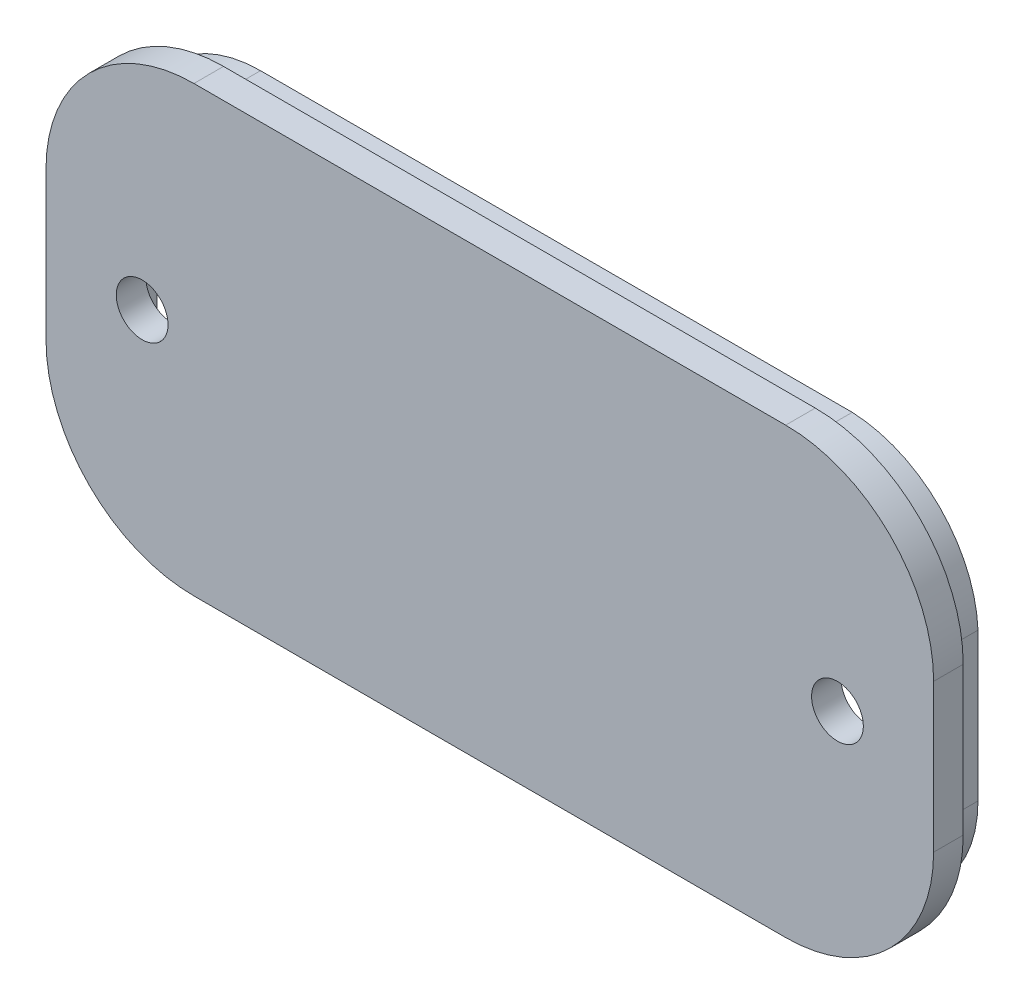
ISO-10303-21;
HEADER;
FILE_DESCRIPTION(('STEP AP214'),'2;1');
FILE_NAME('part.step','',(''),(''),'','','');
FILE_SCHEMA(('AUTOMOTIVE_DESIGN { 1 0 10303 214 1 1 1 1 }'));
ENDSEC;
DATA;
#1=APPLICATION_CONTEXT('core data for automotive mechanical design processes');
#2=APPLICATION_PROTOCOL_DEFINITION('international standard','automotive_design',2000,#1);
#3=PRODUCT_CONTEXT('',#1,'mechanical');
#4=PRODUCT('Part','Part','',(#3));
#5=PRODUCT_RELATED_PRODUCT_CATEGORY('part','',(#4));
#6=PRODUCT_DEFINITION_FORMATION('','',#4);
#7=PRODUCT_DEFINITION_CONTEXT('part definition',#1,'design');
#8=PRODUCT_DEFINITION('design','',#6,#7);
#9=PRODUCT_DEFINITION_SHAPE('','',#8);
#10=(LENGTH_UNIT() NAMED_UNIT(*) SI_UNIT(.MILLI.,.METRE.));
#11=(NAMED_UNIT(*) PLANE_ANGLE_UNIT() SI_UNIT($,.RADIAN.));
#12=(NAMED_UNIT(*) SI_UNIT($,.STERADIAN.) SOLID_ANGLE_UNIT());
#13=UNCERTAINTY_MEASURE_WITH_UNIT(LENGTH_MEASURE(1.E-05),#10,'distance_accuracy_value','');
#14=(GEOMETRIC_REPRESENTATION_CONTEXT(3) GLOBAL_UNCERTAINTY_ASSIGNED_CONTEXT((#13)) GLOBAL_UNIT_ASSIGNED_CONTEXT((#10,
#11,#12)) REPRESENTATION_CONTEXT('',''));
#15=CARTESIAN_POINT('',(0.,0.,0.));
#16=DIRECTION('',(0.,0.,1.));
#17=DIRECTION('',(1.,0.,0.));
#18=AXIS2_PLACEMENT_3D('',#15,#16,#17);
#19=CARTESIAN_POINT('',(-20.,-2.,0.));
#20=DIRECTION('',(0.,0.,1.));
#21=DIRECTION('',(1.,0.,0.));
#22=AXIS2_PLACEMENT_3D('',#19,#20,#21);
#23=PLANE('',#22);
#24=CARTESIAN_POINT('',(-23.5,3.,0.));
#25=DIRECTION('',(0.,0.,1.));
#26=DIRECTION('',(1.,0.,0.));
#27=AXIS2_PLACEMENT_3D('',#24,#25,#26);
#28=CIRCLE('',#27,1.75);
#29=CARTESIAN_POINT('',(-21.75,3.,0.));
#30=VERTEX_POINT('',#29);
#31=EDGE_CURVE('E313',#30,#30,#28,.T.);
#32=ORIENTED_EDGE('',*,*,#31,.T.);
#33=EDGE_LOOP('',(#32));
#34=FACE_BOUND('',#33,.T.);
#35=CARTESIAN_POINT('',(23.5,3.,0.));
#36=DIRECTION('',(0.,0.,1.));
#37=DIRECTION('',(1.,0.,0.));
#38=AXIS2_PLACEMENT_3D('',#35,#36,#37);
#39=CIRCLE('',#38,1.75);
#40=CARTESIAN_POINT('',(25.25,3.,0.));
#41=VERTEX_POINT('',#40);
#42=EDGE_CURVE('E347',#41,#41,#39,.T.);
#43=ORIENTED_EDGE('',*,*,#42,.T.);
#44=EDGE_LOOP('',(#43));
#45=FACE_BOUND('',#44,.T.);
#46=CARTESIAN_POINT('',(-19.6238436825551,-1.62384368255508,0.));
#47=DIRECTION('',(0.,0.,1.));
#48=DIRECTION('',(1.,0.,0.));
#49=AXIS2_PLACEMENT_3D('',#46,#47,#48);
#50=CIRCLE('',#49,7.38412317265306);
#51=CARTESIAN_POINT('',(-27.0079668552081,-1.62384368255508,0.));
#52=VERTEX_POINT('',#51);
#53=CARTESIAN_POINT('',(-19.6238436825551,-9.00796685520814,0.));
#54=VERTEX_POINT('',#53);
#55=EDGE_CURVE('E270',#52,#54,#50,.T.);
#56=ORIENTED_EDGE('',*,*,#55,.F.);
#57=DIRECTION('',(0.,1.,0.));
#58=VECTOR('',#57,1.);
#59=CARTESIAN_POINT('',(-27.0079668552081,0.,0.));
#60=LINE('',#59,#58);
#61=CARTESIAN_POINT('',(-27.0079668552082,7.62384368255508,0.));
#62=VERTEX_POINT('',#61);
#63=EDGE_CURVE('E210',#52,#62,#60,.T.);
#64=ORIENTED_EDGE('',*,*,#63,.T.);
#65=CARTESIAN_POINT('',(-19.6238436825551,7.62384368255508,0.));
#66=DIRECTION('',(0.,0.,1.));
#67=DIRECTION('',(1.,0.,0.));
#68=AXIS2_PLACEMENT_3D('',#65,#66,#67);
#69=CIRCLE('',#68,7.38412317265306);
#70=CARTESIAN_POINT('',(-19.6238436825551,15.0079668552081,0.));
#71=VERTEX_POINT('',#70);
#72=EDGE_CURVE('E52',#62,#71,#69,.F.);
#73=ORIENTED_EDGE('',*,*,#72,.T.);
#74=DIRECTION('',(0.99999991759081,-0.000405978292554137,0.));
#75=VECTOR('',#74,1.);
#76=CARTESIAN_POINT('',(0.00608967388646691,14.9999975277244,0.));
#77=LINE('',#76,#75);
#78=CARTESIAN_POINT('',(0.,15.,0.));
#79=VERTEX_POINT('',#78);
#80=EDGE_CURVE('E274',#71,#79,#77,.T.);
#81=ORIENTED_EDGE('',*,*,#80,.T.);
#82=DIRECTION('',(-0.99999991759081,-0.000405978292554402,0.));
#83=VECTOR('',#82,1.);
#84=CARTESIAN_POINT('',(-0.00608967388647089,14.9999975277244,0.));
#85=LINE('',#84,#83);
#86=CARTESIAN_POINT('',(19.6238436825551,15.0079668552081,0.));
#87=VERTEX_POINT('',#86);
#88=EDGE_CURVE('E277',#87,#79,#85,.T.);
#89=ORIENTED_EDGE('',*,*,#88,.F.);
#90=CARTESIAN_POINT('',(19.6238436825551,7.62384368255508,0.));
#91=DIRECTION('',(0.,0.,1.));
#92=DIRECTION('',(1.,0.,0.));
#93=AXIS2_PLACEMENT_3D('',#90,#91,#92);
#94=CIRCLE('',#93,7.38412317265306);
#95=CARTESIAN_POINT('',(27.0079668552082,7.62384368255508,0.));
#96=VERTEX_POINT('',#95);
#97=EDGE_CURVE('E280',#96,#87,#94,.T.);
#98=ORIENTED_EDGE('',*,*,#97,.F.);
#99=DIRECTION('',(0.,1.,0.));
#100=VECTOR('',#99,1.);
#101=CARTESIAN_POINT('',(27.0079668552082,0.,0.));
#102=LINE('',#101,#100);
#103=CARTESIAN_POINT('',(27.0079668552082,-1.62384368255507,0.));
#104=VERTEX_POINT('',#103);
#105=EDGE_CURVE('E282',#104,#96,#102,.T.);
#106=ORIENTED_EDGE('',*,*,#105,.F.);
#107=CARTESIAN_POINT('',(19.6238436825551,-1.62384368255507,0.));
#108=DIRECTION('',(0.,0.,1.));
#109=DIRECTION('',(1.,0.,0.));
#110=AXIS2_PLACEMENT_3D('',#107,#108,#109);
#111=CIRCLE('',#110,7.38412317265306);
#112=CARTESIAN_POINT('',(19.6238436825551,-9.00796685520813,0.));
#113=VERTEX_POINT('',#112);
#114=EDGE_CURVE('E284',#104,#113,#111,.F.);
#115=ORIENTED_EDGE('',*,*,#114,.T.);
#116=DIRECTION('',(-1.,0.,0.));
#117=VECTOR('',#116,1.);
#118=CARTESIAN_POINT('',(0.,-9.00796685520814,0.));
#119=LINE('',#118,#117);
#120=EDGE_CURVE('E287',#113,#54,#119,.T.);
#121=ORIENTED_EDGE('',*,*,#120,.T.);
#122=EDGE_LOOP('',(#56,#64,#73,#81,#89,#98,#106,#115,#121));
#123=FACE_BOUND('',#122,.T.);
#124=ADVANCED_FACE('F37',(#34,#45,#123),#23,.F.);
#125=CARTESIAN_POINT('',(-20.,-2.,0.));
#126=DIRECTION('',(0.,0.,1.));
#127=DIRECTION('',(1.,0.,0.));
#128=AXIS2_PLACEMENT_3D('',#125,#126,#127);
#129=CIRCLE('',#128,10.);
#130=CARTESIAN_POINT('',(-30.,-2.,0.));
#131=VERTEX_POINT('',#130);
#132=CARTESIAN_POINT('',(-20.,-12.,0.));
#133=VERTEX_POINT('',#132);
#134=EDGE_CURVE('E353',#131,#133,#129,.T.);
#135=ORIENTED_EDGE('',*,*,#134,.F.);
#136=DIRECTION('',(0.,-1.,0.));
#137=VECTOR('',#136,1.);
#138=CARTESIAN_POINT('',(-30.,8.,0.));
#139=LINE('',#138,#137);
#140=CARTESIAN_POINT('',(-30.,8.,0.));
#141=VERTEX_POINT('',#140);
#142=EDGE_CURVE('E360',#141,#131,#139,.T.);
#143=ORIENTED_EDGE('',*,*,#142,.F.);
#144=CARTESIAN_POINT('',(-20.,8.,0.));
#145=DIRECTION('',(0.,0.,1.));
#146=DIRECTION('',(1.,0.,0.));
#147=AXIS2_PLACEMENT_3D('',#144,#145,#146);
#148=CIRCLE('',#147,10.);
#149=CARTESIAN_POINT('',(-20.,18.,0.));
#150=VERTEX_POINT('',#149);
#151=EDGE_CURVE('E387',#150,#141,#148,.T.);
#152=ORIENTED_EDGE('',*,*,#151,.F.);
#153=DIRECTION('',(-1.,0.,0.));
#154=VECTOR('',#153,1.);
#155=CARTESIAN_POINT('',(20.,18.,0.));
#156=LINE('',#155,#154);
#157=CARTESIAN_POINT('',(20.,18.,0.));
#158=VERTEX_POINT('',#157);
#159=EDGE_CURVE('E385',#158,#150,#156,.T.);
#160=ORIENTED_EDGE('',*,*,#159,.F.);
#161=CARTESIAN_POINT('',(20.,8.,0.));
#162=DIRECTION('',(0.,0.,1.));
#163=DIRECTION('',(1.,0.,0.));
#164=AXIS2_PLACEMENT_3D('',#161,#162,#163);
#165=CIRCLE('',#164,10.);
#166=CARTESIAN_POINT('',(30.,8.,0.));
#167=VERTEX_POINT('',#166);
#168=EDGE_CURVE('E383',#167,#158,#165,.T.);
#169=ORIENTED_EDGE('',*,*,#168,.F.);
#170=DIRECTION('',(0.,1.,0.));
#171=VECTOR('',#170,1.);
#172=CARTESIAN_POINT('',(30.,-2.,0.));
#173=LINE('',#172,#171);
#174=CARTESIAN_POINT('',(30.,-2.,0.));
#175=VERTEX_POINT('',#174);
#176=EDGE_CURVE('E381',#175,#167,#173,.T.);
#177=ORIENTED_EDGE('',*,*,#176,.F.);
#178=CARTESIAN_POINT('',(20.,-2.,0.));
#179=DIRECTION('',(0.,0.,1.));
#180=DIRECTION('',(1.,0.,0.));
#181=AXIS2_PLACEMENT_3D('',#178,#179,#180);
#182=CIRCLE('',#181,10.);
#183=CARTESIAN_POINT('',(20.,-12.,0.));
#184=VERTEX_POINT('',#183);
#185=EDGE_CURVE('E379',#184,#175,#182,.T.);
#186=ORIENTED_EDGE('',*,*,#185,.F.);
#187=DIRECTION('',(1.,0.,0.));
#188=VECTOR('',#187,1.);
#189=CARTESIAN_POINT('',(-20.,-12.,0.));
#190=LINE('',#189,#188);
#191=EDGE_CURVE('E377',#133,#184,#190,.T.);
#192=ORIENTED_EDGE('',*,*,#191,.F.);
#193=EDGE_LOOP('',(#135,#143,#152,#160,#169,#177,#186,#192));
#194=FACE_BOUND('',#193,.T.);
#195=DIRECTION('',(1.,0.,0.));
#196=VECTOR('',#195,1.);
#197=CARTESIAN_POINT('',(0.,16.5,0.));
#198=LINE('',#197,#196);
#199=CARTESIAN_POINT('',(-20.,16.5,0.));
#200=VERTEX_POINT('',#199);
#201=CARTESIAN_POINT('',(20.,16.5,0.));
#202=VERTEX_POINT('',#201);
#203=EDGE_CURVE('E290',#200,#202,#198,.T.);
#204=ORIENTED_EDGE('',*,*,#203,.F.);
#205=CARTESIAN_POINT('',(-20.,8.,0.));
#206=DIRECTION('',(0.,0.,1.));
#207=DIRECTION('',(1.,0.,0.));
#208=AXIS2_PLACEMENT_3D('',#205,#206,#207);
#209=CIRCLE('',#208,8.5);
#210=CARTESIAN_POINT('',(-28.5,8.,0.));
#211=VERTEX_POINT('',#210);
#212=EDGE_CURVE('E293',#200,#211,#209,.T.);
#213=ORIENTED_EDGE('',*,*,#212,.T.);
#214=DIRECTION('',(0.,-1.,0.));
#215=VECTOR('',#214,1.);
#216=CARTESIAN_POINT('',(-28.5,0.,0.));
#217=LINE('',#216,#215);
#218=CARTESIAN_POINT('',(-28.5,-2.,0.));
#219=VERTEX_POINT('',#218);
#220=EDGE_CURVE('E60',#211,#219,#217,.T.);
#221=ORIENTED_EDGE('',*,*,#220,.T.);
#222=CARTESIAN_POINT('',(-20.,-2.,0.));
#223=DIRECTION('',(0.,0.,1.));
#224=DIRECTION('',(1.,0.,0.));
#225=AXIS2_PLACEMENT_3D('',#222,#223,#224);
#226=CIRCLE('',#225,8.5);
#227=CARTESIAN_POINT('',(-20.,-10.5,0.));
#228=VERTEX_POINT('',#227);
#229=EDGE_CURVE('E297',#219,#228,#226,.T.);
#230=ORIENTED_EDGE('',*,*,#229,.T.);
#231=DIRECTION('',(1.,0.,0.));
#232=VECTOR('',#231,1.);
#233=CARTESIAN_POINT('',(0.,-10.5,0.));
#234=LINE('',#233,#232);
#235=CARTESIAN_POINT('',(20.,-10.5,0.));
#236=VERTEX_POINT('',#235);
#237=EDGE_CURVE('E300',#228,#236,#234,.T.);
#238=ORIENTED_EDGE('',*,*,#237,.T.);
#239=CARTESIAN_POINT('',(20.,-2.,0.));
#240=DIRECTION('',(0.,0.,1.));
#241=DIRECTION('',(1.,0.,0.));
#242=AXIS2_PLACEMENT_3D('',#239,#240,#241);
#243=CIRCLE('',#242,8.5);
#244=CARTESIAN_POINT('',(28.5,-1.99999999999999,0.));
#245=VERTEX_POINT('',#244);
#246=EDGE_CURVE('E303',#236,#245,#243,.T.);
#247=ORIENTED_EDGE('',*,*,#246,.T.);
#248=DIRECTION('',(0.,-1.,0.));
#249=VECTOR('',#248,1.);
#250=CARTESIAN_POINT('',(28.5,0.,0.));
#251=LINE('',#250,#249);
#252=CARTESIAN_POINT('',(28.5,8.00000000000001,0.));
#253=VERTEX_POINT('',#252);
#254=EDGE_CURVE('E306',#253,#245,#251,.T.);
#255=ORIENTED_EDGE('',*,*,#254,.F.);
#256=CARTESIAN_POINT('',(19.6238436825551,7.62384368255508,0.));
#257=DIRECTION('',(0.,0.,1.));
#258=DIRECTION('',(1.,0.,0.));
#259=AXIS2_PLACEMENT_3D('',#256,#257,#258);
#260=CIRCLE('',#259,8.88412317265306);
#261=EDGE_CURVE('E224',#253,#202,#260,.T.);
#262=ORIENTED_EDGE('',*,*,#261,.T.);
#263=EDGE_LOOP('',(#204,#213,#221,#230,#238,#247,#255,#262));
#264=FACE_BOUND('',#263,.T.);
#265=ADVANCED_FACE('F417',(#194,#264),#23,.F.);
#266=CARTESIAN_POINT('',(-20.,-2.,2.));
#267=DIRECTION('',(0.,0.,1.));
#268=DIRECTION('',(1.,0.,0.));
#269=AXIS2_PLACEMENT_3D('',#266,#267,#268);
#270=PLANE('',#269);
#271=CARTESIAN_POINT('',(23.5,3.,2.));
#272=DIRECTION('',(0.,0.,1.));
#273=DIRECTION('',(1.,0.,0.));
#274=AXIS2_PLACEMENT_3D('',#271,#272,#273);
#275=CIRCLE('',#274,1.75);
#276=CARTESIAN_POINT('',(25.25,3.,2.));
#277=VERTEX_POINT('',#276);
#278=EDGE_CURVE('E350',#277,#277,#275,.T.);
#279=ORIENTED_EDGE('',*,*,#278,.F.);
#280=EDGE_LOOP('',(#279));
#281=FACE_BOUND('',#280,.T.);
#282=CARTESIAN_POINT('',(-20.,-2.,2.));
#283=DIRECTION('',(0.,0.,1.));
#284=DIRECTION('',(1.,0.,0.));
#285=AXIS2_PLACEMENT_3D('',#282,#283,#284);
#286=CIRCLE('',#285,10.);
#287=CARTESIAN_POINT('',(-30.,-2.,2.));
#288=VERTEX_POINT('',#287);
#289=CARTESIAN_POINT('',(-20.,-12.,2.));
#290=VERTEX_POINT('',#289);
#291=EDGE_CURVE('E356',#288,#290,#286,.T.);
#292=ORIENTED_EDGE('',*,*,#291,.T.);
#293=DIRECTION('',(1.,0.,0.));
#294=VECTOR('',#293,1.);
#295=CARTESIAN_POINT('',(-20.,-12.,2.));
#296=LINE('',#295,#294);
#297=CARTESIAN_POINT('',(20.,-12.,2.));
#298=VERTEX_POINT('',#297);
#299=EDGE_CURVE('E359',#290,#298,#296,.T.);
#300=ORIENTED_EDGE('',*,*,#299,.T.);
#301=CARTESIAN_POINT('',(20.,-2.,2.));
#302=DIRECTION('',(0.,0.,1.));
#303=DIRECTION('',(1.,0.,0.));
#304=AXIS2_PLACEMENT_3D('',#301,#302,#303);
#305=CIRCLE('',#304,10.);
#306=CARTESIAN_POINT('',(30.,-2.,2.));
#307=VERTEX_POINT('',#306);
#308=EDGE_CURVE('E362',#298,#307,#305,.T.);
#309=ORIENTED_EDGE('',*,*,#308,.T.);
#310=DIRECTION('',(0.,1.,0.));
#311=VECTOR('',#310,1.);
#312=CARTESIAN_POINT('',(30.,-2.,2.));
#313=LINE('',#312,#311);
#314=CARTESIAN_POINT('',(30.,8.,2.));
#315=VERTEX_POINT('',#314);
#316=EDGE_CURVE('E364',#307,#315,#313,.T.);
#317=ORIENTED_EDGE('',*,*,#316,.T.);
#318=CARTESIAN_POINT('',(20.,8.,2.));
#319=DIRECTION('',(0.,0.,1.));
#320=DIRECTION('',(1.,0.,0.));
#321=AXIS2_PLACEMENT_3D('',#318,#319,#320);
#322=CIRCLE('',#321,10.);
#323=CARTESIAN_POINT('',(20.,18.,2.));
#324=VERTEX_POINT('',#323);
#325=EDGE_CURVE('E366',#315,#324,#322,.T.);
#326=ORIENTED_EDGE('',*,*,#325,.T.);
#327=DIRECTION('',(-1.,0.,0.));
#328=VECTOR('',#327,1.);
#329=CARTESIAN_POINT('',(20.,18.,2.));
#330=LINE('',#329,#328);
#331=CARTESIAN_POINT('',(-20.,18.,2.));
#332=VERTEX_POINT('',#331);
#333=EDGE_CURVE('E368',#324,#332,#330,.T.);
#334=ORIENTED_EDGE('',*,*,#333,.T.);
#335=CARTESIAN_POINT('',(-20.,8.,2.));
#336=DIRECTION('',(0.,0.,1.));
#337=DIRECTION('',(1.,0.,0.));
#338=AXIS2_PLACEMENT_3D('',#335,#336,#337);
#339=CIRCLE('',#338,10.);
#340=CARTESIAN_POINT('',(-30.,8.,2.));
#341=VERTEX_POINT('',#340);
#342=EDGE_CURVE('E370',#332,#341,#339,.T.);
#343=ORIENTED_EDGE('',*,*,#342,.T.);
#344=DIRECTION('',(0.,-1.,0.));
#345=VECTOR('',#344,1.);
#346=CARTESIAN_POINT('',(-30.,8.,2.));
#347=LINE('',#346,#345);
#348=EDGE_CURVE('E372',#341,#288,#347,.T.);
#349=ORIENTED_EDGE('',*,*,#348,.T.);
#350=EDGE_LOOP('',(#292,#300,#309,#317,#326,#334,#343,#349));
#351=FACE_BOUND('',#350,.T.);
#352=CARTESIAN_POINT('',(-23.5,3.,2.));
#353=DIRECTION('',(0.,0.,1.));
#354=DIRECTION('',(1.,0.,0.));
#355=AXIS2_PLACEMENT_3D('',#352,#353,#354);
#356=CIRCLE('',#355,1.75);
#357=CARTESIAN_POINT('',(-21.75,3.,2.));
#358=VERTEX_POINT('',#357);
#359=EDGE_CURVE('E344',#358,#358,#356,.T.);
#360=ORIENTED_EDGE('',*,*,#359,.F.);
#361=EDGE_LOOP('',(#360));
#362=FACE_BOUND('',#361,.T.);
#363=ADVANCED_FACE('F431',(#281,#351,#362),#270,.T.);
#364=CARTESIAN_POINT('',(-20.,-2.,2.));
#365=DIRECTION('',(0.,0.,-1.));
#366=DIRECTION('',(-1.,0.,0.));
#367=AXIS2_PLACEMENT_3D('',#364,#365,#366);
#368=CYLINDRICAL_SURFACE('',#367,10.);
#369=ORIENTED_EDGE('',*,*,#134,.T.);
#370=DIRECTION('',(0.,0.,-1.));
#371=VECTOR('',#370,1.);
#372=CARTESIAN_POINT('',(-20.,-12.,2.));
#373=LINE('',#372,#371);
#374=EDGE_CURVE('E11',#290,#133,#373,.T.);
#375=ORIENTED_EDGE('',*,*,#374,.F.);
#376=ORIENTED_EDGE('',*,*,#291,.F.);
#377=DIRECTION('',(0.,0.,-1.));
#378=VECTOR('',#377,1.);
#379=CARTESIAN_POINT('',(-30.,-2.,2.));
#380=LINE('',#379,#378);
#381=EDGE_CURVE('E374',#288,#131,#380,.T.);
#382=ORIENTED_EDGE('',*,*,#381,.T.);
#383=EDGE_LOOP('',(#369,#375,#376,#382));
#384=FACE_BOUND('',#383,.T.);
#385=ADVANCED_FACE('F39',(#384),#368,.T.);
#386=CARTESIAN_POINT('',(-20.,-12.,2.));
#387=DIRECTION('',(0.,1.,0.));
#388=DIRECTION('',(-1.,0.,0.));
#389=AXIS2_PLACEMENT_3D('',#386,#387,#388);
#390=PLANE('',#389);
#391=ORIENTED_EDGE('',*,*,#191,.T.);
#392=DIRECTION('',(0.,0.,-1.));
#393=VECTOR('',#392,1.);
#394=CARTESIAN_POINT('',(20.,-12.,2.));
#395=LINE('',#394,#393);
#396=EDGE_CURVE('E45',#298,#184,#395,.T.);
#397=ORIENTED_EDGE('',*,*,#396,.F.);
#398=ORIENTED_EDGE('',*,*,#299,.F.);
#399=ORIENTED_EDGE('',*,*,#374,.T.);
#400=EDGE_LOOP('',(#391,#397,#398,#399));
#401=FACE_BOUND('',#400,.T.);
#402=ADVANCED_FACE('F436',(#401),#390,.F.);
#403=CARTESIAN_POINT('',(20.,-2.,2.));
#404=DIRECTION('',(0.,0.,-1.));
#405=DIRECTION('',(-1.,0.,0.));
#406=AXIS2_PLACEMENT_3D('',#403,#404,#405);
#407=CYLINDRICAL_SURFACE('',#406,10.);
#408=ORIENTED_EDGE('',*,*,#185,.T.);
#409=DIRECTION('',(0.,0.,-1.));
#410=VECTOR('',#409,1.);
#411=CARTESIAN_POINT('',(30.,-2.,2.));
#412=LINE('',#411,#410);
#413=EDGE_CURVE('E404',#307,#175,#412,.T.);
#414=ORIENTED_EDGE('',*,*,#413,.F.);
#415=ORIENTED_EDGE('',*,*,#308,.F.);
#416=ORIENTED_EDGE('',*,*,#396,.T.);
#417=EDGE_LOOP('',(#408,#414,#415,#416));
#418=FACE_BOUND('',#417,.T.);
#419=ADVANCED_FACE('F411',(#418),#407,.T.);
#420=CARTESIAN_POINT('',(30.,-2.,2.));
#421=DIRECTION('',(-1.,0.,0.));
#422=DIRECTION('',(0.,0.,1.));
#423=AXIS2_PLACEMENT_3D('',#420,#421,#422);
#424=PLANE('',#423);
#425=ORIENTED_EDGE('',*,*,#176,.T.);
#426=DIRECTION('',(0.,0.,-1.));
#427=VECTOR('',#426,1.);
#428=CARTESIAN_POINT('',(30.,8.,2.));
#429=LINE('',#428,#427);
#430=EDGE_CURVE('E401',#315,#167,#429,.T.);
#431=ORIENTED_EDGE('',*,*,#430,.F.);
#432=ORIENTED_EDGE('',*,*,#316,.F.);
#433=ORIENTED_EDGE('',*,*,#413,.T.);
#434=EDGE_LOOP('',(#425,#431,#432,#433));
#435=FACE_BOUND('',#434,.T.);
#436=ADVANCED_FACE('F423',(#435),#424,.F.);
#437=CARTESIAN_POINT('',(20.,8.,2.));
#438=DIRECTION('',(0.,0.,-1.));
#439=DIRECTION('',(-1.,0.,0.));
#440=AXIS2_PLACEMENT_3D('',#437,#438,#439);
#441=CYLINDRICAL_SURFACE('',#440,10.);
#442=ORIENTED_EDGE('',*,*,#168,.T.);
#443=DIRECTION('',(0.,0.,-1.));
#444=VECTOR('',#443,1.);
#445=CARTESIAN_POINT('',(20.,18.,2.));
#446=LINE('',#445,#444);
#447=EDGE_CURVE('E398',#324,#158,#446,.T.);
#448=ORIENTED_EDGE('',*,*,#447,.F.);
#449=ORIENTED_EDGE('',*,*,#325,.F.);
#450=ORIENTED_EDGE('',*,*,#430,.T.);
#451=EDGE_LOOP('',(#442,#448,#449,#450));
#452=FACE_BOUND('',#451,.T.);
#453=ADVANCED_FACE('F427',(#452),#441,.T.);
#454=CARTESIAN_POINT('',(20.,18.,2.));
#455=DIRECTION('',(0.,-1.,0.));
#456=DIRECTION('',(0.,0.,-1.));
#457=AXIS2_PLACEMENT_3D('',#454,#455,#456);
#458=PLANE('',#457);
#459=ORIENTED_EDGE('',*,*,#159,.T.);
#460=DIRECTION('',(0.,0.,-1.));
#461=VECTOR('',#460,1.);
#462=CARTESIAN_POINT('',(-20.,18.,2.));
#463=LINE('',#462,#461);
#464=EDGE_CURVE('E395',#332,#150,#463,.T.);
#465=ORIENTED_EDGE('',*,*,#464,.F.);
#466=ORIENTED_EDGE('',*,*,#333,.F.);
#467=ORIENTED_EDGE('',*,*,#447,.T.);
#468=EDGE_LOOP('',(#459,#465,#466,#467));
#469=FACE_BOUND('',#468,.T.);
#470=ADVANCED_FACE('F449',(#469),#458,.F.);
#471=CARTESIAN_POINT('',(-20.,8.,2.));
#472=DIRECTION('',(0.,0.,-1.));
#473=DIRECTION('',(-1.,0.,0.));
#474=AXIS2_PLACEMENT_3D('',#471,#472,#473);
#475=CYLINDRICAL_SURFACE('',#474,10.);
#476=ORIENTED_EDGE('',*,*,#151,.T.);
#477=DIRECTION('',(0.,0.,-1.));
#478=VECTOR('',#477,1.);
#479=CARTESIAN_POINT('',(-30.,8.,2.));
#480=LINE('',#479,#478);
#481=EDGE_CURVE('E392',#341,#141,#480,.T.);
#482=ORIENTED_EDGE('',*,*,#481,.F.);
#483=ORIENTED_EDGE('',*,*,#342,.F.);
#484=ORIENTED_EDGE('',*,*,#464,.T.);
#485=EDGE_LOOP('',(#476,#482,#483,#484));
#486=FACE_BOUND('',#485,.T.);
#487=ADVANCED_FACE('F447',(#486),#475,.T.);
#488=CARTESIAN_POINT('',(-30.,8.,2.));
#489=DIRECTION('',(1.,0.,0.));
#490=DIRECTION('',(0.,1.,0.));
#491=AXIS2_PLACEMENT_3D('',#488,#489,#490);
#492=PLANE('',#491);
#493=ORIENTED_EDGE('',*,*,#142,.T.);
#494=ORIENTED_EDGE('',*,*,#381,.F.);
#495=ORIENTED_EDGE('',*,*,#348,.F.);
#496=ORIENTED_EDGE('',*,*,#481,.T.);
#497=EDGE_LOOP('',(#493,#494,#495,#496));
#498=FACE_BOUND('',#497,.T.);
#499=ADVANCED_FACE('F442',(#498),#492,.F.);
#500=CARTESIAN_POINT('',(23.5,3.,2.));
#501=DIRECTION('',(0.,0.,-1.));
#502=DIRECTION('',(-1.,0.,0.));
#503=AXIS2_PLACEMENT_3D('',#500,#501,#502);
#504=CYLINDRICAL_SURFACE('',#503,1.75);
#505=ORIENTED_EDGE('',*,*,#278,.T.);
#506=EDGE_LOOP('',(#505));
#507=FACE_BOUND('',#506,.T.);
#508=ORIENTED_EDGE('',*,*,#42,.F.);
#509=EDGE_LOOP('',(#508));
#510=FACE_BOUND('',#509,.T.);
#511=ADVANCED_FACE('F469',(#507,#510),#504,.F.);
#512=CARTESIAN_POINT('',(-23.5,3.,2.));
#513=DIRECTION('',(0.,0.,-1.));
#514=DIRECTION('',(-1.,0.,0.));
#515=AXIS2_PLACEMENT_3D('',#512,#513,#514);
#516=CYLINDRICAL_SURFACE('',#515,1.75);
#517=ORIENTED_EDGE('',*,*,#359,.T.);
#518=EDGE_LOOP('',(#517));
#519=FACE_BOUND('',#518,.T.);
#520=ORIENTED_EDGE('',*,*,#31,.F.);
#521=EDGE_LOOP('',(#520));
#522=FACE_BOUND('',#521,.T.);
#523=ADVANCED_FACE('F473',(#519,#522),#516,.F.);
#524=CARTESIAN_POINT('',(0.,16.5,-2.5));
#525=DIRECTION('',(0.,-1.,0.));
#526=DIRECTION('',(1.,0.,0.));
#527=AXIS2_PLACEMENT_3D('',#524,#525,#526);
#528=PLANE('',#527);
#529=ORIENTED_EDGE('',*,*,#203,.T.);
#530=DIRECTION('',(0.,0.,1.));
#531=VECTOR('',#530,1.);
#532=CARTESIAN_POINT('',(20.,16.5,-2.5));
#533=LINE('',#532,#531);
#534=CARTESIAN_POINT('',(20.,16.5,-2.5));
#535=VERTEX_POINT('',#534);
#536=EDGE_CURVE('E311',#535,#202,#533,.T.);
#537=ORIENTED_EDGE('',*,*,#536,.F.);
#538=DIRECTION('',(1.,0.,0.));
#539=VECTOR('',#538,1.);
#540=CARTESIAN_POINT('',(0.,16.5,-2.5));
#541=LINE('',#540,#539);
#542=CARTESIAN_POINT('',(-20.,16.5,-2.5));
#543=VERTEX_POINT('',#542);
#544=EDGE_CURVE('E249',#543,#535,#541,.T.);
#545=ORIENTED_EDGE('',*,*,#544,.F.);
#546=DIRECTION('',(0.,0.,1.));
#547=VECTOR('',#546,1.);
#548=CARTESIAN_POINT('',(-20.,16.5,-2.5));
#549=LINE('',#548,#547);
#550=EDGE_CURVE('E326',#543,#200,#549,.T.);
#551=ORIENTED_EDGE('',*,*,#550,.T.);
#552=EDGE_LOOP('',(#529,#537,#545,#551));
#553=FACE_BOUND('',#552,.T.);
#554=ADVANCED_FACE('F478',(#553),#528,.F.);
#555=CARTESIAN_POINT('',(19.6238436825551,7.62384368255508,-2.5));
#556=DIRECTION('',(0.,0.,1.));
#557=DIRECTION('',(1.,0.,0.));
#558=AXIS2_PLACEMENT_3D('',#555,#556,#557);
#559=CYLINDRICAL_SURFACE('',#558,8.88412317265306);
#560=ORIENTED_EDGE('',*,*,#261,.F.);
#561=DIRECTION('',(0.,0.,1.));
#562=VECTOR('',#561,1.);
#563=CARTESIAN_POINT('',(28.5,8.00000000000001,-2.5));
#564=LINE('',#563,#562);
#565=CARTESIAN_POINT('',(28.5,8.00000000000001,-2.5));
#566=VERTEX_POINT('',#565);
#567=EDGE_CURVE('E314',#566,#253,#564,.T.);
#568=ORIENTED_EDGE('',*,*,#567,.F.);
#569=CARTESIAN_POINT('',(19.6238436825551,7.62384368255508,-2.5));
#570=DIRECTION('',(0.,0.,1.));
#571=DIRECTION('',(1.,0.,0.));
#572=AXIS2_PLACEMENT_3D('',#569,#570,#571);
#573=CIRCLE('',#572,8.88412317265306);
#574=EDGE_CURVE('E215',#566,#535,#573,.T.);
#575=ORIENTED_EDGE('',*,*,#574,.T.);
#576=ORIENTED_EDGE('',*,*,#536,.T.);
#577=EDGE_LOOP('',(#560,#568,#575,#576));
#578=FACE_BOUND('',#577,.T.);
#579=ADVANCED_FACE('F518',(#578),#559,.T.);
#580=CARTESIAN_POINT('',(28.5,0.,-2.5));
#581=DIRECTION('',(-1.,0.,0.));
#582=DIRECTION('',(0.,-1.,0.));
#583=AXIS2_PLACEMENT_3D('',#580,#581,#582);
#584=PLANE('',#583);
#585=ORIENTED_EDGE('',*,*,#254,.T.);
#586=DIRECTION('',(0.,0.,1.));
#587=VECTOR('',#586,1.);
#588=CARTESIAN_POINT('',(28.5,-1.99999999999999,-2.5));
#589=LINE('',#588,#587);
#590=CARTESIAN_POINT('',(28.5,-1.99999999999999,-2.5));
#591=VERTEX_POINT('',#590);
#592=EDGE_CURVE('E316',#591,#245,#589,.T.);
#593=ORIENTED_EDGE('',*,*,#592,.F.);
#594=DIRECTION('',(0.,-1.,0.));
#595=VECTOR('',#594,1.);
#596=CARTESIAN_POINT('',(28.5,0.,-2.5));
#597=LINE('',#596,#595);
#598=EDGE_CURVE('E266',#566,#591,#597,.T.);
#599=ORIENTED_EDGE('',*,*,#598,.F.);
#600=ORIENTED_EDGE('',*,*,#567,.T.);
#601=EDGE_LOOP('',(#585,#593,#599,#600));
#602=FACE_BOUND('',#601,.T.);
#603=ADVANCED_FACE('F536',(#602),#584,.F.);
#604=CARTESIAN_POINT('',(20.,-2.,-2.5));
#605=DIRECTION('',(0.,0.,1.));
#606=DIRECTION('',(1.,0.,0.));
#607=AXIS2_PLACEMENT_3D('',#604,#605,#606);
#608=CYLINDRICAL_SURFACE('',#607,8.5);
#609=ORIENTED_EDGE('',*,*,#246,.F.);
#610=DIRECTION('',(0.,0.,1.));
#611=VECTOR('',#610,1.);
#612=CARTESIAN_POINT('',(20.,-10.5,-2.5));
#613=LINE('',#612,#611);
#614=CARTESIAN_POINT('',(20.,-10.5,-2.5));
#615=VERTEX_POINT('',#614);
#616=EDGE_CURVE('E318',#615,#236,#613,.T.);
#617=ORIENTED_EDGE('',*,*,#616,.F.);
#618=CARTESIAN_POINT('',(20.,-2.,-2.5));
#619=DIRECTION('',(0.,0.,1.));
#620=DIRECTION('',(1.,0.,0.));
#621=AXIS2_PLACEMENT_3D('',#618,#619,#620);
#622=CIRCLE('',#621,8.5);
#623=EDGE_CURVE('E263',#615,#591,#622,.T.);
#624=ORIENTED_EDGE('',*,*,#623,.T.);
#625=ORIENTED_EDGE('',*,*,#592,.T.);
#626=EDGE_LOOP('',(#609,#617,#624,#625));
#627=FACE_BOUND('',#626,.T.);
#628=ADVANCED_FACE('F532',(#627),#608,.T.);
#629=CARTESIAN_POINT('',(0.,-10.5,-2.5));
#630=DIRECTION('',(0.,-1.,0.));
#631=DIRECTION('',(1.,0.,0.));
#632=AXIS2_PLACEMENT_3D('',#629,#630,#631);
#633=PLANE('',#632);
#634=ORIENTED_EDGE('',*,*,#237,.F.);
#635=DIRECTION('',(0.,0.,1.));
#636=VECTOR('',#635,1.);
#637=CARTESIAN_POINT('',(-20.,-10.5,-2.5));
#638=LINE('',#637,#636);
#639=CARTESIAN_POINT('',(-20.,-10.5,-2.5));
#640=VERTEX_POINT('',#639);
#641=EDGE_CURVE('E320',#640,#228,#638,.T.);
#642=ORIENTED_EDGE('',*,*,#641,.F.);
#643=DIRECTION('',(1.,0.,0.));
#644=VECTOR('',#643,1.);
#645=CARTESIAN_POINT('',(0.,-10.5,-2.5));
#646=LINE('',#645,#644);
#647=EDGE_CURVE('E260',#640,#615,#646,.T.);
#648=ORIENTED_EDGE('',*,*,#647,.T.);
#649=ORIENTED_EDGE('',*,*,#616,.T.);
#650=EDGE_LOOP('',(#634,#642,#648,#649));
#651=FACE_BOUND('',#650,.T.);
#652=ADVANCED_FACE('F528',(#651),#633,.T.);
#653=CARTESIAN_POINT('',(-20.,-2.,-2.5));
#654=DIRECTION('',(0.,0.,1.));
#655=DIRECTION('',(1.,0.,0.));
#656=AXIS2_PLACEMENT_3D('',#653,#654,#655);
#657=CYLINDRICAL_SURFACE('',#656,8.5);
#658=ORIENTED_EDGE('',*,*,#229,.F.);
#659=DIRECTION('',(0.,0.,1.));
#660=VECTOR('',#659,1.);
#661=CARTESIAN_POINT('',(-28.5,-2.,-2.5));
#662=LINE('',#661,#660);
#663=CARTESIAN_POINT('',(-28.5,-2.,-2.5));
#664=VERTEX_POINT('',#663);
#665=EDGE_CURVE('E322',#664,#219,#662,.T.);
#666=ORIENTED_EDGE('',*,*,#665,.F.);
#667=CARTESIAN_POINT('',(-20.,-2.,-2.5));
#668=DIRECTION('',(0.,0.,1.));
#669=DIRECTION('',(1.,0.,0.));
#670=AXIS2_PLACEMENT_3D('',#667,#668,#669);
#671=CIRCLE('',#670,8.5);
#672=EDGE_CURVE('E257',#664,#640,#671,.T.);
#673=ORIENTED_EDGE('',*,*,#672,.T.);
#674=ORIENTED_EDGE('',*,*,#641,.T.);
#675=EDGE_LOOP('',(#658,#666,#673,#674));
#676=FACE_BOUND('',#675,.T.);
#677=ADVANCED_FACE('F525',(#676),#657,.T.);
#678=CARTESIAN_POINT('',(-28.5,0.,-2.5));
#679=DIRECTION('',(-1.,0.,0.));
#680=DIRECTION('',(0.,0.,1.));
#681=AXIS2_PLACEMENT_3D('',#678,#679,#680);
#682=PLANE('',#681);
#683=ORIENTED_EDGE('',*,*,#220,.F.);
#684=DIRECTION('',(0.,0.,1.));
#685=VECTOR('',#684,1.);
#686=CARTESIAN_POINT('',(-28.5,8.,-2.5));
#687=LINE('',#686,#685);
#688=CARTESIAN_POINT('',(-28.5,8.,-2.5));
#689=VERTEX_POINT('',#688);
#690=EDGE_CURVE('E324',#689,#211,#687,.T.);
#691=ORIENTED_EDGE('',*,*,#690,.F.);
#692=DIRECTION('',(0.,-1.,0.));
#693=VECTOR('',#692,1.);
#694=CARTESIAN_POINT('',(-28.5,0.,-2.5));
#695=LINE('',#694,#693);
#696=EDGE_CURVE('E254',#689,#664,#695,.T.);
#697=ORIENTED_EDGE('',*,*,#696,.T.);
#698=ORIENTED_EDGE('',*,*,#665,.T.);
#699=EDGE_LOOP('',(#683,#691,#697,#698));
#700=FACE_BOUND('',#699,.T.);
#701=ADVANCED_FACE('F486',(#700),#682,.T.);
#702=CARTESIAN_POINT('',(-19.6238436825551,-1.62384368255508,-2.5));
#703=DIRECTION('',(0.,0.,1.));
#704=DIRECTION('',(1.,0.,0.));
#705=AXIS2_PLACEMENT_3D('',#702,#703,#704);
#706=CYLINDRICAL_SURFACE('',#705,7.38412317265306);
#707=ORIENTED_EDGE('',*,*,#55,.T.);
#708=DIRECTION('',(0.,0.,1.));
#709=VECTOR('',#708,1.);
#710=CARTESIAN_POINT('',(-19.6238436825551,-9.00796685520814,-2.5));
#711=LINE('',#710,#709);
#712=CARTESIAN_POINT('',(-19.6238436825551,-9.00796685520814,-2.5));
#713=VERTEX_POINT('',#712);
#714=EDGE_CURVE('E220',#713,#54,#711,.T.);
#715=ORIENTED_EDGE('',*,*,#714,.F.);
#716=CARTESIAN_POINT('',(-19.6238436825551,-1.62384368255508,-2.5));
#717=DIRECTION('',(0.,0.,1.));
#718=DIRECTION('',(1.,0.,0.));
#719=AXIS2_PLACEMENT_3D('',#716,#717,#718);
#720=CIRCLE('',#719,7.38412317265306);
#721=CARTESIAN_POINT('',(-27.0079668552081,-1.62384368255508,-2.5));
#722=VERTEX_POINT('',#721);
#723=EDGE_CURVE('E218',#722,#713,#720,.T.);
#724=ORIENTED_EDGE('',*,*,#723,.F.);
#725=DIRECTION('',(0.,0.,1.));
#726=VECTOR('',#725,1.);
#727=CARTESIAN_POINT('',(-27.0079668552081,-1.62384368255508,-2.5));
#728=LINE('',#727,#726);
#729=EDGE_CURVE('E204',#722,#52,#728,.T.);
#730=ORIENTED_EDGE('',*,*,#729,.T.);
#731=EDGE_LOOP('',(#707,#715,#724,#730));
#732=FACE_BOUND('',#731,.T.);
#733=ADVANCED_FACE('F219',(#732),#706,.F.);
#734=CARTESIAN_POINT('',(0.,-9.00796685520814,-2.5));
#735=DIRECTION('',(0.,1.,0.));
#736=DIRECTION('',(-1.,0.,0.));
#737=AXIS2_PLACEMENT_3D('',#734,#735,#736);
#738=PLANE('',#737);
#739=ORIENTED_EDGE('',*,*,#120,.F.);
#740=DIRECTION('',(0.,0.,1.));
#741=VECTOR('',#740,1.);
#742=CARTESIAN_POINT('',(19.6238436825551,-9.00796685520813,-2.5));
#743=LINE('',#742,#741);
#744=CARTESIAN_POINT('',(19.6238436825551,-9.00796685520813,-2.5));
#745=VERTEX_POINT('',#744);
#746=EDGE_CURVE('E329',#745,#113,#743,.T.);
#747=ORIENTED_EDGE('',*,*,#746,.F.);
#748=DIRECTION('',(-1.,0.,0.));
#749=VECTOR('',#748,1.);
#750=CARTESIAN_POINT('',(0.,-9.00796685520814,-2.5));
#751=LINE('',#750,#749);
#752=EDGE_CURVE('E247',#745,#713,#751,.T.);
#753=ORIENTED_EDGE('',*,*,#752,.T.);
#754=ORIENTED_EDGE('',*,*,#714,.T.);
#755=EDGE_LOOP('',(#739,#747,#753,#754));
#756=FACE_BOUND('',#755,.T.);
#757=ADVANCED_FACE('F485',(#756),#738,.T.);
#758=CARTESIAN_POINT('',(19.6238436825551,-1.62384368255507,-2.5));
#759=DIRECTION('',(0.,0.,1.));
#760=DIRECTION('',(1.,0.,0.));
#761=AXIS2_PLACEMENT_3D('',#758,#759,#760);
#762=CYLINDRICAL_SURFACE('',#761,7.38412317265306);
#763=ORIENTED_EDGE('',*,*,#114,.F.);
#764=DIRECTION('',(0.,0.,1.));
#765=VECTOR('',#764,1.);
#766=CARTESIAN_POINT('',(27.0079668552082,-1.62384368255507,-2.5));
#767=LINE('',#766,#765);
#768=CARTESIAN_POINT('',(27.0079668552082,-1.62384368255507,-2.5));
#769=VERTEX_POINT('',#768);
#770=EDGE_CURVE('E331',#769,#104,#767,.T.);
#771=ORIENTED_EDGE('',*,*,#770,.F.);
#772=CARTESIAN_POINT('',(19.6238436825551,-1.62384368255507,-2.5));
#773=DIRECTION('',(0.,0.,1.));
#774=DIRECTION('',(1.,0.,0.));
#775=AXIS2_PLACEMENT_3D('',#772,#773,#774);
#776=CIRCLE('',#775,7.38412317265306);
#777=EDGE_CURVE('E244',#769,#745,#776,.F.);
#778=ORIENTED_EDGE('',*,*,#777,.T.);
#779=ORIENTED_EDGE('',*,*,#746,.T.);
#780=EDGE_LOOP('',(#763,#771,#778,#779));
#781=FACE_BOUND('',#780,.T.);
#782=ADVANCED_FACE('F508',(#781),#762,.F.);
#783=CARTESIAN_POINT('',(27.0079668552082,0.,-2.5));
#784=DIRECTION('',(1.,0.,0.));
#785=DIRECTION('',(0.,1.,0.));
#786=AXIS2_PLACEMENT_3D('',#783,#784,#785);
#787=PLANE('',#786);
#788=ORIENTED_EDGE('',*,*,#105,.T.);
#789=DIRECTION('',(0.,0.,1.));
#790=VECTOR('',#789,1.);
#791=CARTESIAN_POINT('',(27.0079668552082,7.62384368255508,-2.5));
#792=LINE('',#791,#790);
#793=CARTESIAN_POINT('',(27.0079668552082,7.62384368255508,-2.5));
#794=VERTEX_POINT('',#793);
#795=EDGE_CURVE('E333',#794,#96,#792,.T.);
#796=ORIENTED_EDGE('',*,*,#795,.F.);
#797=DIRECTION('',(0.,1.,0.));
#798=VECTOR('',#797,1.);
#799=CARTESIAN_POINT('',(27.0079668552082,0.,-2.5));
#800=LINE('',#799,#798);
#801=EDGE_CURVE('E242',#769,#794,#800,.T.);
#802=ORIENTED_EDGE('',*,*,#801,.F.);
#803=ORIENTED_EDGE('',*,*,#770,.T.);
#804=EDGE_LOOP('',(#788,#796,#802,#803));
#805=FACE_BOUND('',#804,.T.);
#806=ADVANCED_FACE('F504',(#805),#787,.F.);
#807=CARTESIAN_POINT('',(19.6238436825551,7.62384368255508,-2.5));
#808=DIRECTION('',(0.,0.,1.));
#809=DIRECTION('',(1.,0.,0.));
#810=AXIS2_PLACEMENT_3D('',#807,#808,#809);
#811=CYLINDRICAL_SURFACE('',#810,7.38412317265306);
#812=ORIENTED_EDGE('',*,*,#97,.T.);
#813=DIRECTION('',(0.,0.,1.));
#814=VECTOR('',#813,1.);
#815=CARTESIAN_POINT('',(19.6238436825551,15.0079668552081,-2.5));
#816=LINE('',#815,#814);
#817=CARTESIAN_POINT('',(19.6238436825551,15.0079668552081,-2.5));
#818=VERTEX_POINT('',#817);
#819=EDGE_CURVE('E336',#818,#87,#816,.T.);
#820=ORIENTED_EDGE('',*,*,#819,.F.);
#821=CARTESIAN_POINT('',(19.6238436825551,7.62384368255508,-2.5));
#822=DIRECTION('',(0.,0.,1.));
#823=DIRECTION('',(1.,0.,0.));
#824=AXIS2_PLACEMENT_3D('',#821,#822,#823);
#825=CIRCLE('',#824,7.38412317265306);
#826=EDGE_CURVE('E240',#794,#818,#825,.T.);
#827=ORIENTED_EDGE('',*,*,#826,.F.);
#828=ORIENTED_EDGE('',*,*,#795,.T.);
#829=EDGE_LOOP('',(#812,#820,#827,#828));
#830=FACE_BOUND('',#829,.T.);
#831=ADVANCED_FACE('F500',(#830),#811,.F.);
#832=CARTESIAN_POINT('',(-0.00608967388647089,14.9999975277244,-2.5));
#833=DIRECTION('',(-0.000405978292554402,0.99999991759081,0.));
#834=DIRECTION('',(-0.99999991759081,-0.000405978292554402,0.));
#835=AXIS2_PLACEMENT_3D('',#832,#833,#834);
#836=PLANE('',#835);
#837=ORIENTED_EDGE('',*,*,#88,.T.);
#838=DIRECTION('',(0.,0.,1.));
#839=VECTOR('',#838,1.);
#840=CARTESIAN_POINT('',(0.,15.,-2.5));
#841=LINE('',#840,#839);
#842=CARTESIAN_POINT('',(0.,15.,-2.5));
#843=VERTEX_POINT('',#842);
#844=EDGE_CURVE('E339',#843,#79,#841,.T.);
#845=ORIENTED_EDGE('',*,*,#844,.F.);
#846=DIRECTION('',(-0.99999991759081,-0.000405978292554402,0.));
#847=VECTOR('',#846,1.);
#848=CARTESIAN_POINT('',(-0.00608967388647089,14.9999975277244,-2.5));
#849=LINE('',#848,#847);
#850=EDGE_CURVE('E238',#818,#843,#849,.T.);
#851=ORIENTED_EDGE('',*,*,#850,.F.);
#852=ORIENTED_EDGE('',*,*,#819,.T.);
#853=EDGE_LOOP('',(#837,#845,#851,#852));
#854=FACE_BOUND('',#853,.T.);
#855=ADVANCED_FACE('F496',(#854),#836,.F.);
#856=CARTESIAN_POINT('',(0.00608967388646691,14.9999975277244,-2.5));
#857=DIRECTION('',(-0.000405978292554137,-0.99999991759081,0.));
#858=DIRECTION('',(0.99999991759081,-0.000405978292554137,0.));
#859=AXIS2_PLACEMENT_3D('',#856,#857,#858);
#860=PLANE('',#859);
#861=ORIENTED_EDGE('',*,*,#80,.F.);
#862=DIRECTION('',(0.,0.,1.));
#863=VECTOR('',#862,1.);
#864=CARTESIAN_POINT('',(-19.6238436825551,15.0079668552081,-2.5));
#865=LINE('',#864,#863);
#866=CARTESIAN_POINT('',(-19.6238436825551,15.0079668552081,-2.5));
#867=VERTEX_POINT('',#866);
#868=EDGE_CURVE('E341',#867,#71,#865,.T.);
#869=ORIENTED_EDGE('',*,*,#868,.F.);
#870=DIRECTION('',(0.99999991759081,-0.000405978292554137,0.));
#871=VECTOR('',#870,1.);
#872=CARTESIAN_POINT('',(0.00608967388646691,14.9999975277244,-2.5));
#873=LINE('',#872,#871);
#874=EDGE_CURVE('E233',#867,#843,#873,.T.);
#875=ORIENTED_EDGE('',*,*,#874,.T.);
#876=ORIENTED_EDGE('',*,*,#844,.T.);
#877=EDGE_LOOP('',(#861,#869,#875,#876));
#878=FACE_BOUND('',#877,.T.);
#879=ADVANCED_FACE('F493',(#878),#860,.T.);
#880=CARTESIAN_POINT('',(-19.6238436825551,7.62384368255508,-2.5));
#881=DIRECTION('',(0.,0.,1.));
#882=DIRECTION('',(1.,0.,0.));
#883=AXIS2_PLACEMENT_3D('',#880,#881,#882);
#884=CYLINDRICAL_SURFACE('',#883,7.38412317265306);
#885=ORIENTED_EDGE('',*,*,#72,.F.);
#886=DIRECTION('',(0.,0.,1.));
#887=VECTOR('',#886,1.);
#888=CARTESIAN_POINT('',(-27.0079668552082,7.62384368255508,-2.5));
#889=LINE('',#888,#887);
#890=CARTESIAN_POINT('',(-27.0079668552082,7.62384368255508,-2.5));
#891=VERTEX_POINT('',#890);
#892=EDGE_CURVE('E214',#891,#62,#889,.T.);
#893=ORIENTED_EDGE('',*,*,#892,.F.);
#894=CARTESIAN_POINT('',(-19.6238436825551,7.62384368255508,-2.5));
#895=DIRECTION('',(0.,0.,1.));
#896=DIRECTION('',(1.,0.,0.));
#897=AXIS2_PLACEMENT_3D('',#894,#895,#896);
#898=CIRCLE('',#897,7.38412317265306);
#899=EDGE_CURVE('E231',#891,#867,#898,.F.);
#900=ORIENTED_EDGE('',*,*,#899,.T.);
#901=ORIENTED_EDGE('',*,*,#868,.T.);
#902=EDGE_LOOP('',(#885,#893,#900,#901));
#903=FACE_BOUND('',#902,.T.);
#904=ADVANCED_FACE('F490',(#903),#884,.F.);
#905=CARTESIAN_POINT('',(-27.0079668552081,0.,-2.5));
#906=DIRECTION('',(1.,0.,0.));
#907=DIRECTION('',(0.,1.,0.));
#908=AXIS2_PLACEMENT_3D('',#905,#906,#907);
#909=PLANE('',#908);
#910=ORIENTED_EDGE('',*,*,#63,.F.);
#911=ORIENTED_EDGE('',*,*,#729,.F.);
#912=DIRECTION('',(0.,1.,0.));
#913=VECTOR('',#912,1.);
#914=CARTESIAN_POINT('',(-27.0079668552081,0.,-2.5));
#915=LINE('',#914,#913);
#916=EDGE_CURVE('E208',#722,#891,#915,.T.);
#917=ORIENTED_EDGE('',*,*,#916,.T.);
#918=ORIENTED_EDGE('',*,*,#892,.T.);
#919=EDGE_LOOP('',(#910,#911,#917,#918));
#920=FACE_BOUND('',#919,.T.);
#921=ADVANCED_FACE('F206',(#920),#909,.T.);
#922=CARTESIAN_POINT('',(-20.,8.,-2.5));
#923=DIRECTION('',(0.,0.,1.));
#924=DIRECTION('',(1.,0.,0.));
#925=AXIS2_PLACEMENT_3D('',#922,#923,#924);
#926=CYLINDRICAL_SURFACE('',#925,8.5);
#927=ORIENTED_EDGE('',*,*,#212,.F.);
#928=ORIENTED_EDGE('',*,*,#550,.F.);
#929=CARTESIAN_POINT('',(-20.,8.,-2.5));
#930=DIRECTION('',(0.,0.,1.));
#931=DIRECTION('',(1.,0.,0.));
#932=AXIS2_PLACEMENT_3D('',#929,#930,#931);
#933=CIRCLE('',#932,8.5);
#934=EDGE_CURVE('E251',#543,#689,#933,.T.);
#935=ORIENTED_EDGE('',*,*,#934,.T.);
#936=ORIENTED_EDGE('',*,*,#690,.T.);
#937=EDGE_LOOP('',(#927,#928,#935,#936));
#938=FACE_BOUND('',#937,.T.);
#939=ADVANCED_FACE('F489',(#938),#926,.T.);
#940=CARTESIAN_POINT('',(0.,0.,-2.5));
#941=DIRECTION('',(0.,0.,1.));
#942=DIRECTION('',(1.,0.,0.));
#943=AXIS2_PLACEMENT_3D('',#940,#941,#942);
#944=PLANE('',#943);
#945=ORIENTED_EDGE('',*,*,#723,.T.);
#946=ORIENTED_EDGE('',*,*,#752,.F.);
#947=ORIENTED_EDGE('',*,*,#777,.F.);
#948=ORIENTED_EDGE('',*,*,#801,.T.);
#949=ORIENTED_EDGE('',*,*,#826,.T.);
#950=ORIENTED_EDGE('',*,*,#850,.T.);
#951=ORIENTED_EDGE('',*,*,#874,.F.);
#952=ORIENTED_EDGE('',*,*,#899,.F.);
#953=ORIENTED_EDGE('',*,*,#916,.F.);
#954=EDGE_LOOP('',(#945,#946,#947,#948,#949,#950,#951,#952,#953));
#955=FACE_BOUND('',#954,.T.);
#956=ORIENTED_EDGE('',*,*,#544,.T.);
#957=ORIENTED_EDGE('',*,*,#574,.F.);
#958=ORIENTED_EDGE('',*,*,#598,.T.);
#959=ORIENTED_EDGE('',*,*,#623,.F.);
#960=ORIENTED_EDGE('',*,*,#647,.F.);
#961=ORIENTED_EDGE('',*,*,#672,.F.);
#962=ORIENTED_EDGE('',*,*,#696,.F.);
#963=ORIENTED_EDGE('',*,*,#934,.F.);
#964=EDGE_LOOP('',(#956,#957,#958,#959,#960,#961,#962,#963));
#965=FACE_BOUND('',#964,.T.);
#966=ADVANCED_FACE('F227',(#955,#965),#944,.F.);
#967=CLOSED_SHELL('',(#124,#265,#363,#385,#402,#419,#436,#453,#470,#487,#499,#511,#523,#554,
#579,#603,#628,#652,#677,#701,#733,#757,#782,#806,#831,#855,#879,#904,#921,#939,#966));
#968=MANIFOLD_SOLID_BREP('B2',#967);
#969=ADVANCED_BREP_SHAPE_REPRESENTATION('',(#18,#968),#14);
#970=SHAPE_DEFINITION_REPRESENTATION(#9,#969);
ENDSEC;
END-ISO-10303-21;
